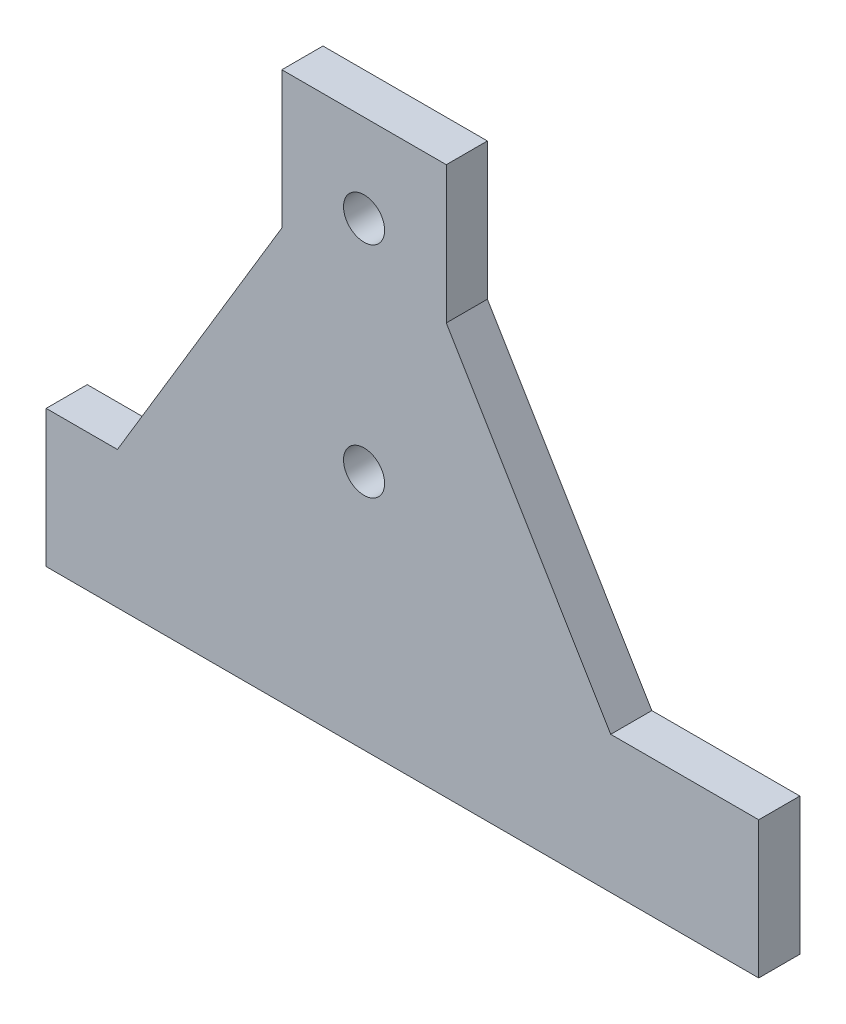
ISO-10303-21;
HEADER;
FILE_DESCRIPTION(('STEP AP214'),'2;1');
FILE_NAME('part.step','',(''),(''),'','','');
FILE_SCHEMA(('AUTOMOTIVE_DESIGN { 1 0 10303 214 1 1 1 1 }'));
ENDSEC;
DATA;
#1=APPLICATION_CONTEXT('core data for automotive mechanical design processes');
#2=APPLICATION_PROTOCOL_DEFINITION('international standard','automotive_design',2000,#1);
#3=PRODUCT_CONTEXT('',#1,'mechanical');
#4=PRODUCT('Part','Part','',(#3));
#5=PRODUCT_RELATED_PRODUCT_CATEGORY('part','',(#4));
#6=PRODUCT_DEFINITION_FORMATION('','',#4);
#7=PRODUCT_DEFINITION_CONTEXT('part definition',#1,'design');
#8=PRODUCT_DEFINITION('design','',#6,#7);
#9=PRODUCT_DEFINITION_SHAPE('','',#8);
#10=(LENGTH_UNIT() NAMED_UNIT(*) SI_UNIT(.MILLI.,.METRE.));
#11=(NAMED_UNIT(*) PLANE_ANGLE_UNIT() SI_UNIT($,.RADIAN.));
#12=(NAMED_UNIT(*) SI_UNIT($,.STERADIAN.) SOLID_ANGLE_UNIT());
#13=UNCERTAINTY_MEASURE_WITH_UNIT(LENGTH_MEASURE(1.E-05),#10,'distance_accuracy_value','');
#14=(GEOMETRIC_REPRESENTATION_CONTEXT(3) GLOBAL_UNCERTAINTY_ASSIGNED_CONTEXT((#13)) GLOBAL_UNIT_ASSIGNED_CONTEXT((#10,
#11,#12)) REPRESENTATION_CONTEXT('',''));
#15=CARTESIAN_POINT('',(0.,0.,0.));
#16=DIRECTION('',(0.,0.,1.));
#17=DIRECTION('',(1.,0.,0.));
#18=AXIS2_PLACEMENT_3D('',#15,#16,#17);
#19=CARTESIAN_POINT('',(0.,0.,15.));
#20=DIRECTION('',(0.,0.,-1.));
#21=DIRECTION('',(-1.,0.,0.));
#22=AXIS2_PLACEMENT_3D('',#19,#20,#21);
#23=PLANE('',#22);
#24=DIRECTION('',(1.,0.,0.));
#25=VECTOR('',#24,1.);
#26=CARTESIAN_POINT('',(130.,0.,15.));
#27=LINE('',#26,#25);
#28=CARTESIAN_POINT('',(-130.,0.,15.));
#29=VERTEX_POINT('',#28);
#30=CARTESIAN_POINT('',(130.,0.,15.));
#31=VERTEX_POINT('',#30);
#32=EDGE_CURVE('E163',#29,#31,#27,.T.);
#33=ORIENTED_EDGE('',*,*,#32,.T.);
#34=DIRECTION('',(0.,1.,0.));
#35=VECTOR('',#34,1.);
#36=CARTESIAN_POINT('',(130.,50.,15.));
#37=LINE('',#36,#35);
#38=CARTESIAN_POINT('',(130.,50.,15.));
#39=VERTEX_POINT('',#38);
#40=EDGE_CURVE('E101',#31,#39,#37,.T.);
#41=ORIENTED_EDGE('',*,*,#40,.T.);
#42=DIRECTION('',(-1.,0.,0.));
#43=VECTOR('',#42,1.);
#44=CARTESIAN_POINT('',(76.,50.,15.));
#45=LINE('',#44,#43);
#46=CARTESIAN_POINT('',(76.,50.,15.));
#47=VERTEX_POINT('',#46);
#48=EDGE_CURVE('E184',#39,#47,#45,.T.);
#49=ORIENTED_EDGE('',*,*,#48,.T.);
#50=DIRECTION('',(-0.514495755427527,0.857492925712544,0.));
#51=VECTOR('',#50,1.);
#52=CARTESIAN_POINT('',(16.,150.,15.));
#53=LINE('',#52,#51);
#54=CARTESIAN_POINT('',(16.,150.,15.));
#55=VERTEX_POINT('',#54);
#56=EDGE_CURVE('E203',#47,#55,#53,.T.);
#57=ORIENTED_EDGE('',*,*,#56,.T.);
#58=DIRECTION('',(0.,1.,0.));
#59=VECTOR('',#58,1.);
#60=CARTESIAN_POINT('',(15.9999999999999,200.,15.));
#61=LINE('',#60,#59);
#62=CARTESIAN_POINT('',(15.9999999999999,200.,15.));
#63=VERTEX_POINT('',#62);
#64=EDGE_CURVE('E200',#55,#63,#61,.T.);
#65=ORIENTED_EDGE('',*,*,#64,.T.);
#66=DIRECTION('',(-1.,0.,0.));
#67=VECTOR('',#66,1.);
#68=CARTESIAN_POINT('',(-44.,200.,15.));
#69=LINE('',#68,#67);
#70=CARTESIAN_POINT('',(-44.,200.,15.));
#71=VERTEX_POINT('',#70);
#72=EDGE_CURVE('E202',#63,#71,#69,.T.);
#73=ORIENTED_EDGE('',*,*,#72,.T.);
#74=DIRECTION('',(0.,-1.,0.));
#75=VECTOR('',#74,1.);
#76=CARTESIAN_POINT('',(-44.,150.,15.));
#77=LINE('',#76,#75);
#78=CARTESIAN_POINT('',(-44.,150.,15.));
#79=VERTEX_POINT('',#78);
#80=EDGE_CURVE('E126',#71,#79,#77,.T.);
#81=ORIENTED_EDGE('',*,*,#80,.T.);
#82=DIRECTION('',(-0.514495755427526,-0.857492925712544,0.));
#83=VECTOR('',#82,1.);
#84=CARTESIAN_POINT('',(-104.,50.,15.));
#85=LINE('',#84,#83);
#86=CARTESIAN_POINT('',(-104.,50.,15.));
#87=VERTEX_POINT('',#86);
#88=EDGE_CURVE('E120',#79,#87,#85,.T.);
#89=ORIENTED_EDGE('',*,*,#88,.T.);
#90=DIRECTION('',(-1.,0.,0.));
#91=VECTOR('',#90,1.);
#92=CARTESIAN_POINT('',(-130.,50.,15.));
#93=LINE('',#92,#91);
#94=CARTESIAN_POINT('',(-130.,50.,15.));
#95=VERTEX_POINT('',#94);
#96=EDGE_CURVE('E124',#87,#95,#93,.T.);
#97=ORIENTED_EDGE('',*,*,#96,.T.);
#98=DIRECTION('',(0.,-1.,0.));
#99=VECTOR('',#98,1.);
#100=CARTESIAN_POINT('',(-130.,0.,15.));
#101=LINE('',#100,#99);
#102=EDGE_CURVE('E52',#95,#29,#101,.T.);
#103=ORIENTED_EDGE('',*,*,#102,.T.);
#104=EDGE_LOOP('',(#33,#41,#49,#57,#65,#73,#81,#89,#97,#103));
#105=FACE_BOUND('',#104,.T.);
#106=CARTESIAN_POINT('',(-14.0000000000001,168.,15.));
#107=DIRECTION('',(0.,0.,1.));
#108=DIRECTION('',(1.,0.,0.));
#109=AXIS2_PLACEMENT_3D('',#106,#107,#108);
#110=CIRCLE('',#109,7.50000000000001);
#111=CARTESIAN_POINT('',(-6.50000000000004,168.,15.));
#112=VERTEX_POINT('',#111);
#113=EDGE_CURVE('E148',#112,#112,#110,.T.);
#114=ORIENTED_EDGE('',*,*,#113,.F.);
#115=EDGE_LOOP('',(#114));
#116=FACE_BOUND('',#115,.T.);
#117=CARTESIAN_POINT('',(-14.0000000000001,88.0000000000002,15.));
#118=DIRECTION('',(0.,0.,1.));
#119=DIRECTION('',(1.,0.,0.));
#120=AXIS2_PLACEMENT_3D('',#117,#118,#119);
#121=CIRCLE('',#120,7.50000000000001);
#122=CARTESIAN_POINT('',(-6.50000000000004,88.0000000000002,15.));
#123=VERTEX_POINT('',#122);
#124=EDGE_CURVE('E214',#123,#123,#121,.T.);
#125=ORIENTED_EDGE('',*,*,#124,.F.);
#126=EDGE_LOOP('',(#125));
#127=FACE_BOUND('',#126,.T.);
#128=ADVANCED_FACE('F35',(#105,#116,#127),#23,.F.);
#129=CARTESIAN_POINT('',(0.,0.,0.));
#130=DIRECTION('',(0.,0.,-1.));
#131=DIRECTION('',(-1.,0.,0.));
#132=AXIS2_PLACEMENT_3D('',#129,#130,#131);
#133=PLANE('',#132);
#134=CARTESIAN_POINT('',(-14.0000000000001,168.,0.));
#135=DIRECTION('',(0.,0.,1.));
#136=DIRECTION('',(1.,0.,0.));
#137=AXIS2_PLACEMENT_3D('',#134,#135,#136);
#138=CIRCLE('',#137,7.50000000000001);
#139=CARTESIAN_POINT('',(-6.50000000000004,168.,0.));
#140=VERTEX_POINT('',#139);
#141=EDGE_CURVE('E211',#140,#140,#138,.T.);
#142=ORIENTED_EDGE('',*,*,#141,.T.);
#143=EDGE_LOOP('',(#142));
#144=FACE_BOUND('',#143,.T.);
#145=DIRECTION('',(1.,0.,0.));
#146=VECTOR('',#145,1.);
#147=CARTESIAN_POINT('',(130.,0.,0.));
#148=LINE('',#147,#146);
#149=CARTESIAN_POINT('',(-130.,0.,0.));
#150=VERTEX_POINT('',#149);
#151=CARTESIAN_POINT('',(130.,0.,0.));
#152=VERTEX_POINT('',#151);
#153=EDGE_CURVE('E144',#150,#152,#148,.T.);
#154=ORIENTED_EDGE('',*,*,#153,.F.);
#155=DIRECTION('',(0.,-1.,0.));
#156=VECTOR('',#155,1.);
#157=CARTESIAN_POINT('',(-130.,0.,0.));
#158=LINE('',#157,#156);
#159=CARTESIAN_POINT('',(-130.,50.,0.));
#160=VERTEX_POINT('',#159);
#161=EDGE_CURVE('E93',#160,#150,#158,.T.);
#162=ORIENTED_EDGE('',*,*,#161,.F.);
#163=DIRECTION('',(-1.,0.,0.));
#164=VECTOR('',#163,1.);
#165=CARTESIAN_POINT('',(-130.,50.,0.));
#166=LINE('',#165,#164);
#167=CARTESIAN_POINT('',(-104.,50.,0.));
#168=VERTEX_POINT('',#167);
#169=EDGE_CURVE('E87',#168,#160,#166,.T.);
#170=ORIENTED_EDGE('',*,*,#169,.F.);
#171=DIRECTION('',(-0.514495755427526,-0.857492925712544,0.));
#172=VECTOR('',#171,1.);
#173=CARTESIAN_POINT('',(-104.,50.,0.));
#174=LINE('',#173,#172);
#175=CARTESIAN_POINT('',(-44.,150.,0.));
#176=VERTEX_POINT('',#175);
#177=EDGE_CURVE('E134',#176,#168,#174,.T.);
#178=ORIENTED_EDGE('',*,*,#177,.F.);
#179=DIRECTION('',(0.,-1.,0.));
#180=VECTOR('',#179,1.);
#181=CARTESIAN_POINT('',(-44.,150.,0.));
#182=LINE('',#181,#180);
#183=CARTESIAN_POINT('',(-44.,200.,0.));
#184=VERTEX_POINT('',#183);
#185=EDGE_CURVE('E158',#184,#176,#182,.T.);
#186=ORIENTED_EDGE('',*,*,#185,.F.);
#187=DIRECTION('',(-1.,0.,0.));
#188=VECTOR('',#187,1.);
#189=CARTESIAN_POINT('',(-44.,200.,0.));
#190=LINE('',#189,#188);
#191=CARTESIAN_POINT('',(15.9999999999999,200.,0.));
#192=VERTEX_POINT('',#191);
#193=EDGE_CURVE('E156',#192,#184,#190,.T.);
#194=ORIENTED_EDGE('',*,*,#193,.F.);
#195=DIRECTION('',(0.,1.,0.));
#196=VECTOR('',#195,1.);
#197=CARTESIAN_POINT('',(15.9999999999999,200.,0.));
#198=LINE('',#197,#196);
#199=CARTESIAN_POINT('',(16.,150.,0.));
#200=VERTEX_POINT('',#199);
#201=EDGE_CURVE('E154',#200,#192,#198,.T.);
#202=ORIENTED_EDGE('',*,*,#201,.F.);
#203=DIRECTION('',(-0.514495755427527,0.857492925712544,0.));
#204=VECTOR('',#203,1.);
#205=CARTESIAN_POINT('',(16.,150.,0.));
#206=LINE('',#205,#204);
#207=CARTESIAN_POINT('',(76.,50.,0.));
#208=VERTEX_POINT('',#207);
#209=EDGE_CURVE('E152',#208,#200,#206,.T.);
#210=ORIENTED_EDGE('',*,*,#209,.F.);
#211=DIRECTION('',(-1.,0.,0.));
#212=VECTOR('',#211,1.);
#213=CARTESIAN_POINT('',(76.,50.,0.));
#214=LINE('',#213,#212);
#215=CARTESIAN_POINT('',(130.,50.,0.));
#216=VERTEX_POINT('',#215);
#217=EDGE_CURVE('E150',#216,#208,#214,.T.);
#218=ORIENTED_EDGE('',*,*,#217,.F.);
#219=DIRECTION('',(0.,1.,0.));
#220=VECTOR('',#219,1.);
#221=CARTESIAN_POINT('',(130.,50.,0.));
#222=LINE('',#221,#220);
#223=EDGE_CURVE('E147',#152,#216,#222,.T.);
#224=ORIENTED_EDGE('',*,*,#223,.F.);
#225=EDGE_LOOP('',(#154,#162,#170,#178,#186,#194,#202,#210,#218,#224));
#226=FACE_BOUND('',#225,.T.);
#227=CARTESIAN_POINT('',(-14.0000000000001,88.0000000000002,0.));
#228=DIRECTION('',(0.,0.,1.));
#229=DIRECTION('',(1.,0.,0.));
#230=AXIS2_PLACEMENT_3D('',#227,#228,#229);
#231=CIRCLE('',#230,7.50000000000001);
#232=CARTESIAN_POINT('',(-6.50000000000004,88.0000000000002,0.));
#233=VERTEX_POINT('',#232);
#234=EDGE_CURVE('E217',#233,#233,#231,.T.);
#235=ORIENTED_EDGE('',*,*,#234,.T.);
#236=EDGE_LOOP('',(#235));
#237=FACE_BOUND('',#236,.T.);
#238=ADVANCED_FACE('F188',(#144,#226,#237),#133,.T.);
#239=CARTESIAN_POINT('',(130.,0.,15.));
#240=DIRECTION('',(0.,1.,0.));
#241=DIRECTION('',(-1.,0.,0.));
#242=AXIS2_PLACEMENT_3D('',#239,#240,#241);
#243=PLANE('',#242);
#244=ORIENTED_EDGE('',*,*,#153,.T.);
#245=DIRECTION('',(0.,0.,-1.));
#246=VECTOR('',#245,1.);
#247=CARTESIAN_POINT('',(130.,0.,15.));
#248=LINE('',#247,#246);
#249=EDGE_CURVE('E11',#31,#152,#248,.T.);
#250=ORIENTED_EDGE('',*,*,#249,.F.);
#251=ORIENTED_EDGE('',*,*,#32,.F.);
#252=DIRECTION('',(0.,0.,-1.));
#253=VECTOR('',#252,1.);
#254=CARTESIAN_POINT('',(-130.,0.,15.));
#255=LINE('',#254,#253);
#256=EDGE_CURVE('E140',#29,#150,#255,.T.);
#257=ORIENTED_EDGE('',*,*,#256,.T.);
#258=EDGE_LOOP('',(#244,#250,#251,#257));
#259=FACE_BOUND('',#258,.T.);
#260=ADVANCED_FACE('F37',(#259),#243,.F.);
#261=CARTESIAN_POINT('',(130.,50.,15.));
#262=DIRECTION('',(-1.,0.,0.));
#263=DIRECTION('',(0.,-1.,0.));
#264=AXIS2_PLACEMENT_3D('',#261,#262,#263);
#265=PLANE('',#264);
#266=ORIENTED_EDGE('',*,*,#223,.T.);
#267=DIRECTION('',(0.,0.,-1.));
#268=VECTOR('',#267,1.);
#269=CARTESIAN_POINT('',(130.,50.,15.));
#270=LINE('',#269,#268);
#271=EDGE_CURVE('E44',#39,#216,#270,.T.);
#272=ORIENTED_EDGE('',*,*,#271,.F.);
#273=ORIENTED_EDGE('',*,*,#40,.F.);
#274=ORIENTED_EDGE('',*,*,#249,.T.);
#275=EDGE_LOOP('',(#266,#272,#273,#274));
#276=FACE_BOUND('',#275,.T.);
#277=ADVANCED_FACE('F257',(#276),#265,.F.);
#278=CARTESIAN_POINT('',(76.,50.,15.));
#279=DIRECTION('',(0.,-1.,0.));
#280=DIRECTION('',(1.,0.,0.));
#281=AXIS2_PLACEMENT_3D('',#278,#279,#280);
#282=PLANE('',#281);
#283=ORIENTED_EDGE('',*,*,#217,.T.);
#284=DIRECTION('',(0.,0.,-1.));
#285=VECTOR('',#284,1.);
#286=CARTESIAN_POINT('',(76.,50.,15.));
#287=LINE('',#286,#285);
#288=EDGE_CURVE('E176',#47,#208,#287,.T.);
#289=ORIENTED_EDGE('',*,*,#288,.F.);
#290=ORIENTED_EDGE('',*,*,#48,.F.);
#291=ORIENTED_EDGE('',*,*,#271,.T.);
#292=EDGE_LOOP('',(#283,#289,#290,#291));
#293=FACE_BOUND('',#292,.T.);
#294=ADVANCED_FACE('F182',(#293),#282,.F.);
#295=CARTESIAN_POINT('',(16.,150.,15.));
#296=DIRECTION('',(-0.857492925712544,-0.514495755427527,0.));
#297=DIRECTION('',(0.514495755427527,-0.857492925712544,0.));
#298=AXIS2_PLACEMENT_3D('',#295,#296,#297);
#299=PLANE('',#298);
#300=ORIENTED_EDGE('',*,*,#209,.T.);
#301=DIRECTION('',(0.,0.,-1.));
#302=VECTOR('',#301,1.);
#303=CARTESIAN_POINT('',(16.,150.,15.));
#304=LINE('',#303,#302);
#305=EDGE_CURVE('E173',#55,#200,#304,.T.);
#306=ORIENTED_EDGE('',*,*,#305,.F.);
#307=ORIENTED_EDGE('',*,*,#56,.F.);
#308=ORIENTED_EDGE('',*,*,#288,.T.);
#309=EDGE_LOOP('',(#300,#306,#307,#308));
#310=FACE_BOUND('',#309,.T.);
#311=ADVANCED_FACE('F194',(#310),#299,.F.);
#312=CARTESIAN_POINT('',(15.9999999999999,200.,15.));
#313=DIRECTION('',(-1.,0.,0.));
#314=DIRECTION('',(0.,-1.,0.));
#315=AXIS2_PLACEMENT_3D('',#312,#313,#314);
#316=PLANE('',#315);
#317=ORIENTED_EDGE('',*,*,#201,.T.);
#318=DIRECTION('',(0.,0.,-1.));
#319=VECTOR('',#318,1.);
#320=CARTESIAN_POINT('',(15.9999999999999,200.,15.));
#321=LINE('',#320,#319);
#322=EDGE_CURVE('E170',#63,#192,#321,.T.);
#323=ORIENTED_EDGE('',*,*,#322,.F.);
#324=ORIENTED_EDGE('',*,*,#64,.F.);
#325=ORIENTED_EDGE('',*,*,#305,.T.);
#326=EDGE_LOOP('',(#317,#323,#324,#325));
#327=FACE_BOUND('',#326,.T.);
#328=ADVANCED_FACE('F198',(#327),#316,.F.);
#329=CARTESIAN_POINT('',(-44.,200.,15.));
#330=DIRECTION('',(0.,-1.,0.));
#331=DIRECTION('',(1.,0.,0.));
#332=AXIS2_PLACEMENT_3D('',#329,#330,#331);
#333=PLANE('',#332);
#334=ORIENTED_EDGE('',*,*,#193,.T.);
#335=DIRECTION('',(0.,0.,-1.));
#336=VECTOR('',#335,1.);
#337=CARTESIAN_POINT('',(-44.,200.,15.));
#338=LINE('',#337,#336);
#339=EDGE_CURVE('E167',#71,#184,#338,.T.);
#340=ORIENTED_EDGE('',*,*,#339,.F.);
#341=ORIENTED_EDGE('',*,*,#72,.F.);
#342=ORIENTED_EDGE('',*,*,#322,.T.);
#343=EDGE_LOOP('',(#334,#340,#341,#342));
#344=FACE_BOUND('',#343,.T.);
#345=ADVANCED_FACE('F247',(#344),#333,.F.);
#346=CARTESIAN_POINT('',(-44.,150.,15.));
#347=DIRECTION('',(1.,0.,0.));
#348=DIRECTION('',(0.,0.,-1.));
#349=AXIS2_PLACEMENT_3D('',#346,#347,#348);
#350=PLANE('',#349);
#351=ORIENTED_EDGE('',*,*,#185,.T.);
#352=DIRECTION('',(0.,0.,-1.));
#353=VECTOR('',#352,1.);
#354=CARTESIAN_POINT('',(-44.,150.,15.));
#355=LINE('',#354,#353);
#356=EDGE_CURVE('E135',#79,#176,#355,.T.);
#357=ORIENTED_EDGE('',*,*,#356,.F.);
#358=ORIENTED_EDGE('',*,*,#80,.F.);
#359=ORIENTED_EDGE('',*,*,#339,.T.);
#360=EDGE_LOOP('',(#351,#357,#358,#359));
#361=FACE_BOUND('',#360,.T.);
#362=ADVANCED_FACE('F244',(#361),#350,.F.);
#363=CARTESIAN_POINT('',(-104.,50.,15.));
#364=DIRECTION('',(0.857492925712544,-0.514495755427526,0.));
#365=DIRECTION('',(0.514495755427526,0.857492925712544,0.));
#366=AXIS2_PLACEMENT_3D('',#363,#364,#365);
#367=PLANE('',#366);
#368=ORIENTED_EDGE('',*,*,#177,.T.);
#369=DIRECTION('',(0.,0.,-1.));
#370=VECTOR('',#369,1.);
#371=CARTESIAN_POINT('',(-104.,50.,15.));
#372=LINE('',#371,#370);
#373=EDGE_CURVE('E131',#87,#168,#372,.T.);
#374=ORIENTED_EDGE('',*,*,#373,.F.);
#375=ORIENTED_EDGE('',*,*,#88,.F.);
#376=ORIENTED_EDGE('',*,*,#356,.T.);
#377=EDGE_LOOP('',(#368,#374,#375,#376));
#378=FACE_BOUND('',#377,.T.);
#379=ADVANCED_FACE('F132',(#378),#367,.F.);
#380=CARTESIAN_POINT('',(-130.,50.,15.));
#381=DIRECTION('',(0.,-1.,0.));
#382=DIRECTION('',(0.,0.,-1.));
#383=AXIS2_PLACEMENT_3D('',#380,#381,#382);
#384=PLANE('',#383);
#385=ORIENTED_EDGE('',*,*,#169,.T.);
#386=DIRECTION('',(0.,0.,-1.));
#387=VECTOR('',#386,1.);
#388=CARTESIAN_POINT('',(-130.,50.,15.));
#389=LINE('',#388,#387);
#390=EDGE_CURVE('E136',#95,#160,#389,.T.);
#391=ORIENTED_EDGE('',*,*,#390,.F.);
#392=ORIENTED_EDGE('',*,*,#96,.F.);
#393=ORIENTED_EDGE('',*,*,#373,.T.);
#394=EDGE_LOOP('',(#385,#391,#392,#393));
#395=FACE_BOUND('',#394,.T.);
#396=ADVANCED_FACE('F138',(#395),#384,.F.);
#397=CARTESIAN_POINT('',(-130.,0.,15.));
#398=DIRECTION('',(1.,0.,0.));
#399=DIRECTION('',(0.,1.,0.));
#400=AXIS2_PLACEMENT_3D('',#397,#398,#399);
#401=PLANE('',#400);
#402=ORIENTED_EDGE('',*,*,#161,.T.);
#403=ORIENTED_EDGE('',*,*,#256,.F.);
#404=ORIENTED_EDGE('',*,*,#102,.F.);
#405=ORIENTED_EDGE('',*,*,#390,.T.);
#406=EDGE_LOOP('',(#402,#403,#404,#405));
#407=FACE_BOUND('',#406,.T.);
#408=ADVANCED_FACE('F237',(#407),#401,.F.);
#409=CARTESIAN_POINT('',(-14.0000000000001,168.,15.));
#410=DIRECTION('',(0.,0.,-1.));
#411=DIRECTION('',(-1.,0.,0.));
#412=AXIS2_PLACEMENT_3D('',#409,#410,#411);
#413=CYLINDRICAL_SURFACE('',#412,7.50000000000001);
#414=ORIENTED_EDGE('',*,*,#113,.T.);
#415=EDGE_LOOP('',(#414));
#416=FACE_BOUND('',#415,.T.);
#417=ORIENTED_EDGE('',*,*,#141,.F.);
#418=EDGE_LOOP('',(#417));
#419=FACE_BOUND('',#418,.T.);
#420=ADVANCED_FACE('F234',(#416,#419),#413,.F.);
#421=CARTESIAN_POINT('',(-14.0000000000001,88.0000000000002,15.));
#422=DIRECTION('',(0.,0.,-1.));
#423=DIRECTION('',(-1.,0.,0.));
#424=AXIS2_PLACEMENT_3D('',#421,#422,#423);
#425=CYLINDRICAL_SURFACE('',#424,7.50000000000001);
#426=ORIENTED_EDGE('',*,*,#124,.T.);
#427=EDGE_LOOP('',(#426));
#428=FACE_BOUND('',#427,.T.);
#429=ORIENTED_EDGE('',*,*,#234,.F.);
#430=EDGE_LOOP('',(#429));
#431=FACE_BOUND('',#430,.T.);
#432=ADVANCED_FACE('F223',(#428,#431),#425,.F.);
#433=CLOSED_SHELL('',(#128,#238,#260,#277,#294,#311,#328,#345,#362,#379,#396,#408,#420,#432));
#434=MANIFOLD_SOLID_BREP('B2',#433);
#435=ADVANCED_BREP_SHAPE_REPRESENTATION('',(#18,#434),#14);
#436=SHAPE_DEFINITION_REPRESENTATION(#9,#435);
ENDSEC;
END-ISO-10303-21;
